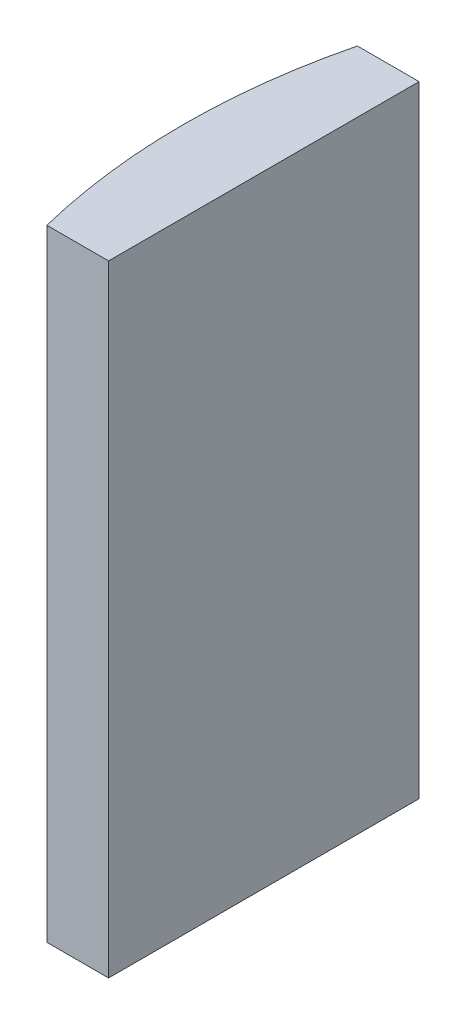
ISO-10303-21;
HEADER;
FILE_DESCRIPTION(('STEP AP214'),'2;1');
FILE_NAME('part.step','',(''),(''),'','','');
FILE_SCHEMA(('AUTOMOTIVE_DESIGN { 1 0 10303 214 1 1 1 1 }'));
ENDSEC;
DATA;
#1=APPLICATION_CONTEXT('core data for automotive mechanical design processes');
#2=APPLICATION_PROTOCOL_DEFINITION('international standard','automotive_design',2000,#1);
#3=PRODUCT_CONTEXT('',#1,'mechanical');
#4=PRODUCT('Part','Part','',(#3));
#5=PRODUCT_RELATED_PRODUCT_CATEGORY('part','',(#4));
#6=PRODUCT_DEFINITION_FORMATION('','',#4);
#7=PRODUCT_DEFINITION_CONTEXT('part definition',#1,'design');
#8=PRODUCT_DEFINITION('design','',#6,#7);
#9=PRODUCT_DEFINITION_SHAPE('','',#8);
#10=(LENGTH_UNIT() NAMED_UNIT(*) SI_UNIT(.MILLI.,.METRE.));
#11=(NAMED_UNIT(*) PLANE_ANGLE_UNIT() SI_UNIT($,.RADIAN.));
#12=(NAMED_UNIT(*) SI_UNIT($,.STERADIAN.) SOLID_ANGLE_UNIT());
#13=UNCERTAINTY_MEASURE_WITH_UNIT(LENGTH_MEASURE(1.E-05),#10,'distance_accuracy_value','');
#14=(GEOMETRIC_REPRESENTATION_CONTEXT(3) GLOBAL_UNCERTAINTY_ASSIGNED_CONTEXT((#13)) GLOBAL_UNIT_ASSIGNED_CONTEXT((#10,
#11,#12)) REPRESENTATION_CONTEXT('',''));
#15=CARTESIAN_POINT('',(0.,0.,0.));
#16=DIRECTION('',(0.,0.,1.));
#17=DIRECTION('',(1.,0.,0.));
#18=AXIS2_PLACEMENT_3D('',#15,#16,#17);
#19=CARTESIAN_POINT('',(4.35520433485127,20.,0.));
#20=DIRECTION('',(0.,-1.,0.));
#21=DIRECTION('',(0.,0.,-1.));
#22=AXIS2_PLACEMENT_3D('',#19,#20,#21);
#23=CYLINDRICAL_SURFACE('',#22,20.68);
#24=CARTESIAN_POINT('',(4.35520433485127,0.,0.));
#25=DIRECTION('',(0.,1.,0.));
#26=DIRECTION('',(0.,0.,1.));
#27=AXIS2_PLACEMENT_3D('',#24,#25,#26);
#28=CIRCLE('',#27,20.68);
#29=CARTESIAN_POINT('',(-15.7112452763779,0.,-5.));
#30=VERTEX_POINT('',#29);
#31=CARTESIAN_POINT('',(-15.7112452763779,0.,5.));
#32=VERTEX_POINT('',#31);
#33=EDGE_CURVE('E100',#30,#32,#28,.T.);
#34=ORIENTED_EDGE('',*,*,#33,.T.);
#35=DIRECTION('',(0.,-1.,0.));
#36=VECTOR('',#35,1.);
#37=CARTESIAN_POINT('',(-15.7112452763779,20.,5.));
#38=LINE('',#37,#36);
#39=CARTESIAN_POINT('',(-15.7112452763779,20.,5.));
#40=VERTEX_POINT('',#39);
#41=EDGE_CURVE('E11',#40,#32,#38,.T.);
#42=ORIENTED_EDGE('',*,*,#41,.F.);
#43=CARTESIAN_POINT('',(4.35520433485127,20.,0.));
#44=DIRECTION('',(0.,1.,0.));
#45=DIRECTION('',(0.,0.,1.));
#46=AXIS2_PLACEMENT_3D('',#43,#44,#45);
#47=CIRCLE('',#46,20.68);
#48=CARTESIAN_POINT('',(-15.7112452763779,20.,-5.));
#49=VERTEX_POINT('',#48);
#50=EDGE_CURVE('E88',#49,#40,#47,.T.);
#51=ORIENTED_EDGE('',*,*,#50,.F.);
#52=DIRECTION('',(0.,-1.,0.));
#53=VECTOR('',#52,1.);
#54=CARTESIAN_POINT('',(-15.7112452763779,20.,-5.));
#55=LINE('',#54,#53);
#56=EDGE_CURVE('E96',#49,#30,#55,.T.);
#57=ORIENTED_EDGE('',*,*,#56,.T.);
#58=EDGE_LOOP('',(#34,#42,#51,#57));
#59=FACE_BOUND('',#58,.T.);
#60=ADVANCED_FACE('F37',(#59),#23,.T.);
#61=CARTESIAN_POINT('',(-15.7112452763779,20.,5.));
#62=DIRECTION('',(0.,0.,-1.));
#63=DIRECTION('',(-1.,0.,0.));
#64=AXIS2_PLACEMENT_3D('',#61,#62,#63);
#65=PLANE('',#64);
#66=DIRECTION('',(1.,0.,0.));
#67=VECTOR('',#66,1.);
#68=CARTESIAN_POINT('',(-15.7112452763779,0.,5.));
#69=LINE('',#68,#67);
#70=CARTESIAN_POINT('',(-13.7247956651487,0.,5.));
#71=VERTEX_POINT('',#70);
#72=EDGE_CURVE('E92',#32,#71,#69,.T.);
#73=ORIENTED_EDGE('',*,*,#72,.T.);
#74=DIRECTION('',(0.,-1.,0.));
#75=VECTOR('',#74,1.);
#76=CARTESIAN_POINT('',(-13.7247956651487,20.,5.));
#77=LINE('',#76,#75);
#78=CARTESIAN_POINT('',(-13.7247956651487,20.,5.));
#79=VERTEX_POINT('',#78);
#80=EDGE_CURVE('E45',#79,#71,#77,.T.);
#81=ORIENTED_EDGE('',*,*,#80,.F.);
#82=DIRECTION('',(1.,0.,0.));
#83=VECTOR('',#82,1.);
#84=CARTESIAN_POINT('',(-15.7112452763779,20.,5.));
#85=LINE('',#84,#83);
#86=EDGE_CURVE('E83',#40,#79,#85,.T.);
#87=ORIENTED_EDGE('',*,*,#86,.F.);
#88=ORIENTED_EDGE('',*,*,#41,.T.);
#89=EDGE_LOOP('',(#73,#81,#87,#88));
#90=FACE_BOUND('',#89,.T.);
#91=ADVANCED_FACE('F91',(#90),#65,.F.);
#92=CARTESIAN_POINT('',(-13.7247956651487,20.,-4.99999999999999));
#93=DIRECTION('',(-1.,0.,0.));
#94=DIRECTION('',(0.,0.,1.));
#95=AXIS2_PLACEMENT_3D('',#92,#93,#94);
#96=PLANE('',#95);
#97=DIRECTION('',(0.,0.,-1.));
#98=VECTOR('',#97,1.);
#99=CARTESIAN_POINT('',(-13.7247956651487,0.,-4.99999999999999));
#100=LINE('',#99,#98);
#101=CARTESIAN_POINT('',(-13.7247956651487,0.,-4.99999999999999));
#102=VERTEX_POINT('',#101);
#103=EDGE_CURVE('E70',#71,#102,#100,.T.);
#104=ORIENTED_EDGE('',*,*,#103,.T.);
#105=DIRECTION('',(0.,-1.,0.));
#106=VECTOR('',#105,1.);
#107=CARTESIAN_POINT('',(-13.7247956651487,20.,-4.99999999999999));
#108=LINE('',#107,#106);
#109=CARTESIAN_POINT('',(-13.7247956651487,20.,-4.99999999999999));
#110=VERTEX_POINT('',#109);
#111=EDGE_CURVE('E93',#110,#102,#108,.T.);
#112=ORIENTED_EDGE('',*,*,#111,.F.);
#113=DIRECTION('',(0.,0.,-1.));
#114=VECTOR('',#113,1.);
#115=CARTESIAN_POINT('',(-13.7247956651487,20.,-4.99999999999999));
#116=LINE('',#115,#114);
#117=EDGE_CURVE('E86',#79,#110,#116,.T.);
#118=ORIENTED_EDGE('',*,*,#117,.F.);
#119=ORIENTED_EDGE('',*,*,#80,.T.);
#120=EDGE_LOOP('',(#104,#112,#118,#119));
#121=FACE_BOUND('',#120,.T.);
#122=ADVANCED_FACE('F94',(#121),#96,.F.);
#123=CARTESIAN_POINT('',(-15.7112452763779,20.,-5.));
#124=DIRECTION('',(0.,0.,1.));
#125=DIRECTION('',(1.,0.,0.));
#126=AXIS2_PLACEMENT_3D('',#123,#124,#125);
#127=PLANE('',#126);
#128=DIRECTION('',(-1.,0.,0.));
#129=VECTOR('',#128,1.);
#130=CARTESIAN_POINT('',(-15.7112452763779,0.,-5.));
#131=LINE('',#130,#129);
#132=EDGE_CURVE('E76',#102,#30,#131,.T.);
#133=ORIENTED_EDGE('',*,*,#132,.T.);
#134=ORIENTED_EDGE('',*,*,#56,.F.);
#135=DIRECTION('',(-1.,0.,0.));
#136=VECTOR('',#135,1.);
#137=CARTESIAN_POINT('',(-15.7112452763779,20.,-5.));
#138=LINE('',#137,#136);
#139=EDGE_CURVE('E53',#110,#49,#138,.T.);
#140=ORIENTED_EDGE('',*,*,#139,.F.);
#141=ORIENTED_EDGE('',*,*,#111,.T.);
#142=EDGE_LOOP('',(#133,#134,#140,#141));
#143=FACE_BOUND('',#142,.T.);
#144=ADVANCED_FACE('F107',(#143),#127,.F.);
#145=CARTESIAN_POINT('',(4.35520433485127,20.,0.));
#146=DIRECTION('',(0.,1.,0.));
#147=DIRECTION('',(0.,0.,1.));
#148=AXIS2_PLACEMENT_3D('',#145,#146,#147);
#149=PLANE('',#148);
#150=ORIENTED_EDGE('',*,*,#50,.T.);
#151=ORIENTED_EDGE('',*,*,#86,.T.);
#152=ORIENTED_EDGE('',*,*,#117,.T.);
#153=ORIENTED_EDGE('',*,*,#139,.T.);
#154=EDGE_LOOP('',(#150,#151,#152,#153));
#155=FACE_BOUND('',#154,.T.);
#156=ADVANCED_FACE('F84',(#155),#149,.T.);
#157=CARTESIAN_POINT('',(4.35520433485127,0.,0.));
#158=DIRECTION('',(0.,1.,0.));
#159=DIRECTION('',(0.,0.,1.));
#160=AXIS2_PLACEMENT_3D('',#157,#158,#159);
#161=PLANE('',#160);
#162=ORIENTED_EDGE('',*,*,#33,.F.);
#163=ORIENTED_EDGE('',*,*,#132,.F.);
#164=ORIENTED_EDGE('',*,*,#103,.F.);
#165=ORIENTED_EDGE('',*,*,#72,.F.);
#166=EDGE_LOOP('',(#162,#163,#164,#165));
#167=FACE_BOUND('',#166,.T.);
#168=ADVANCED_FACE('F110',(#167),#161,.F.);
#169=CLOSED_SHELL('',(#60,#91,#122,#144,#156,#168));
#170=MANIFOLD_SOLID_BREP('B2',#169);
#171=ADVANCED_BREP_SHAPE_REPRESENTATION('',(#18,#170),#14);
#172=SHAPE_DEFINITION_REPRESENTATION(#9,#171);
ENDSEC;
END-ISO-10303-21;
